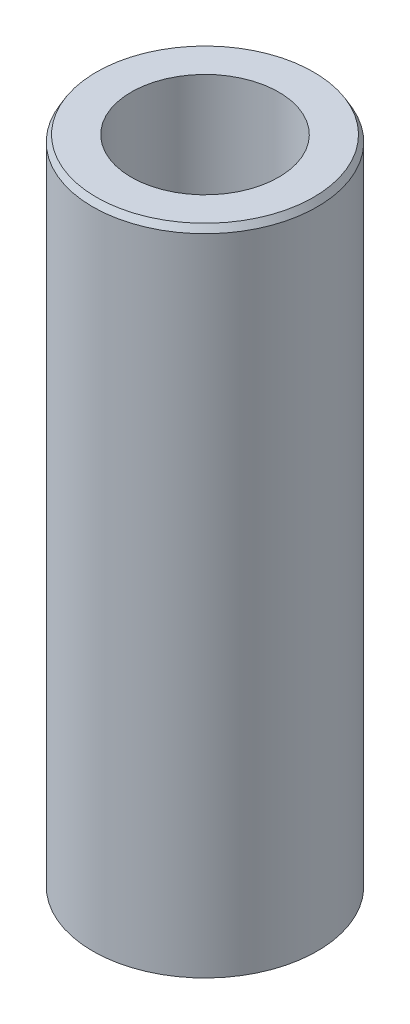
ISO-10303-21;
HEADER;
FILE_DESCRIPTION(('STEP AP214'),'2;1');
FILE_NAME('part.step','',(''),(''),'','','');
FILE_SCHEMA(('AUTOMOTIVE_DESIGN { 1 0 10303 214 1 1 1 1 }'));
ENDSEC;
DATA;
#1=APPLICATION_CONTEXT('core data for automotive mechanical design processes');
#2=APPLICATION_PROTOCOL_DEFINITION('international standard','automotive_design',2000,#1);
#3=PRODUCT_CONTEXT('',#1,'mechanical');
#4=PRODUCT('Part','Part','',(#3));
#5=PRODUCT_RELATED_PRODUCT_CATEGORY('part','',(#4));
#6=PRODUCT_DEFINITION_FORMATION('','',#4);
#7=PRODUCT_DEFINITION_CONTEXT('part definition',#1,'design');
#8=PRODUCT_DEFINITION('design','',#6,#7);
#9=PRODUCT_DEFINITION_SHAPE('','',#8);
#10=(LENGTH_UNIT() NAMED_UNIT(*) SI_UNIT(.MILLI.,.METRE.));
#11=(NAMED_UNIT(*) PLANE_ANGLE_UNIT() SI_UNIT($,.RADIAN.));
#12=(NAMED_UNIT(*) SI_UNIT($,.STERADIAN.) SOLID_ANGLE_UNIT());
#13=UNCERTAINTY_MEASURE_WITH_UNIT(LENGTH_MEASURE(1.E-05),#10,'distance_accuracy_value','');
#14=(GEOMETRIC_REPRESENTATION_CONTEXT(3) GLOBAL_UNCERTAINTY_ASSIGNED_CONTEXT((#13)) GLOBAL_UNIT_ASSIGNED_CONTEXT((#10,
#11,#12)) REPRESENTATION_CONTEXT('',''));
#15=CARTESIAN_POINT('',(0.,0.,0.));
#16=DIRECTION('',(0.,0.,1.));
#17=DIRECTION('',(1.,0.,0.));
#18=AXIS2_PLACEMENT_3D('',#15,#16,#17);
#19=CARTESIAN_POINT('',(0.,58.3154074401787,0.));
#20=DIRECTION('',(0.,-1.,0.));
#21=DIRECTION('',(0.,0.,-1.));
#22=AXIS2_PLACEMENT_3D('',#19,#20,#21);
#23=CYLINDRICAL_SURFACE('',#22,10.);
#24=CARTESIAN_POINT('',(0.,57.7418931094685,0.));
#25=DIRECTION('',(0.,1.,0.));
#26=DIRECTION('',(0.,0.,1.));
#27=AXIS2_PLACEMENT_3D('',#24,#25,#26);
#28=CIRCLE('',#27,10.);
#29=CARTESIAN_POINT('',(0.,57.7418931094685,10.));
#30=VERTEX_POINT('',#29);
#31=EDGE_CURVE('E50',#30,#30,#28,.F.);
#32=ORIENTED_EDGE('',*,*,#31,.T.);
#33=EDGE_LOOP('',(#32));
#34=FACE_BOUND('',#33,.T.);
#35=CARTESIAN_POINT('',(0.,0.331118653219657,0.));
#36=DIRECTION('',(0.,1.,0.));
#37=DIRECTION('',(0.,0.,1.));
#38=AXIS2_PLACEMENT_3D('',#35,#36,#37);
#39=CIRCLE('',#38,10.);
#40=CARTESIAN_POINT('',(0.,0.331118653219657,10.));
#41=VERTEX_POINT('',#40);
#42=EDGE_CURVE('E51',#41,#41,#39,.T.);
#43=ORIENTED_EDGE('',*,*,#42,.T.);
#44=EDGE_LOOP('',(#43));
#45=FACE_BOUND('',#44,.T.);
#46=ADVANCED_FACE('F39',(#34,#45),#23,.T.);
#47=CARTESIAN_POINT('',(0.,58.3154074401787,0.));
#48=DIRECTION('',(0.,1.,0.));
#49=DIRECTION('',(0.,0.,1.));
#50=AXIS2_PLACEMENT_3D('',#47,#48,#49);
#51=PLANE('',#50);
#52=CARTESIAN_POINT('',(0.,58.3154074401787,0.));
#53=DIRECTION('',(0.,1.,0.));
#54=DIRECTION('',(0.,0.,1.));
#55=AXIS2_PLACEMENT_3D('',#52,#53,#54);
#56=CIRCLE('',#55,9.66888134678033);
#57=CARTESIAN_POINT('',(0.,58.3154074401787,9.66888134678033));
#58=VERTEX_POINT('',#57);
#59=EDGE_CURVE('E54',#58,#58,#56,.T.);
#60=ORIENTED_EDGE('',*,*,#59,.T.);
#61=EDGE_LOOP('',(#60));
#62=FACE_BOUND('',#61,.T.);
#63=CARTESIAN_POINT('',(0.,58.3154074401787,0.));
#64=DIRECTION('',(0.,1.,0.));
#65=DIRECTION('',(0.,0.,1.));
#66=AXIS2_PLACEMENT_3D('',#63,#64,#65);
#67=CIRCLE('',#66,6.57091181176588);
#68=CARTESIAN_POINT('',(0.,58.3154074401787,6.57091181176588));
#69=VERTEX_POINT('',#68);
#70=EDGE_CURVE('E58',#69,#69,#67,.T.);
#71=ORIENTED_EDGE('',*,*,#70,.F.);
#72=EDGE_LOOP('',(#71));
#73=FACE_BOUND('',#72,.T.);
#74=ADVANCED_FACE('F69',(#62,#73),#51,.T.);
#75=CARTESIAN_POINT('',(0.,0.,0.));
#76=DIRECTION('',(0.,1.,0.));
#77=DIRECTION('',(0.,0.,1.));
#78=AXIS2_PLACEMENT_3D('',#75,#76,#77);
#79=PLANE('',#78);
#80=CARTESIAN_POINT('',(0.,0.,0.));
#81=DIRECTION('',(0.,1.,0.));
#82=DIRECTION('',(0.,0.,1.));
#83=AXIS2_PLACEMENT_3D('',#80,#81,#82);
#84=CIRCLE('',#83,9.42648566928979);
#85=CARTESIAN_POINT('',(0.,0.,9.42648566928979));
#86=VERTEX_POINT('',#85);
#87=EDGE_CURVE('E10',#86,#86,#84,.F.);
#88=ORIENTED_EDGE('',*,*,#87,.T.);
#89=EDGE_LOOP('',(#88));
#90=FACE_BOUND('',#89,.T.);
#91=CARTESIAN_POINT('',(0.,0.,0.));
#92=DIRECTION('',(0.,1.,0.));
#93=DIRECTION('',(0.,0.,1.));
#94=AXIS2_PLACEMENT_3D('',#91,#92,#93);
#95=CIRCLE('',#94,6.57091181176588);
#96=CARTESIAN_POINT('',(0.,0.,6.57091181176588));
#97=VERTEX_POINT('',#96);
#98=EDGE_CURVE('E63',#97,#97,#95,.T.);
#99=ORIENTED_EDGE('',*,*,#98,.T.);
#100=EDGE_LOOP('',(#99));
#101=FACE_BOUND('',#100,.T.);
#102=ADVANCED_FACE('F75',(#90,#101),#79,.F.);
#103=CARTESIAN_POINT('',(0.,58.3154074401787,0.));
#104=DIRECTION('',(0.,-1.,0.));
#105=DIRECTION('',(0.,0.,-1.));
#106=AXIS2_PLACEMENT_3D('',#103,#104,#105);
#107=CYLINDRICAL_SURFACE('',#106,6.57091181176588);
#108=ORIENTED_EDGE('',*,*,#70,.T.);
#109=EDGE_LOOP('',(#108));
#110=FACE_BOUND('',#109,.T.);
#111=ORIENTED_EDGE('',*,*,#98,.F.);
#112=EDGE_LOOP('',(#111));
#113=FACE_BOUND('',#112,.T.);
#114=ADVANCED_FACE('F70',(#110,#113),#107,.F.);
#115=CARTESIAN_POINT('',(0.,58.3154074401787,0.));
#116=DIRECTION('',(0.,-1.,0.));
#117=DIRECTION('',(0.,0.,-1.));
#118=AXIS2_PLACEMENT_3D('',#115,#116,#117);
#119=CONICAL_SURFACE('',#118,9.66888134678033,0.523598775598298);
#120=ORIENTED_EDGE('',*,*,#31,.F.);
#121=EDGE_LOOP('',(#120));
#122=FACE_BOUND('',#121,.T.);
#123=ORIENTED_EDGE('',*,*,#59,.F.);
#124=EDGE_LOOP('',(#123));
#125=FACE_BOUND('',#124,.T.);
#126=ADVANCED_FACE('F81',(#122,#125),#119,.T.);
#127=CARTESIAN_POINT('',(0.,0.331118653219657,0.));
#128=DIRECTION('',(0.,1.,0.));
#129=DIRECTION('',(0.,0.,1.));
#130=AXIS2_PLACEMENT_3D('',#127,#128,#129);
#131=CONICAL_SURFACE('',#130,10.,1.04719755119659);
#132=ORIENTED_EDGE('',*,*,#87,.F.);
#133=EDGE_LOOP('',(#132));
#134=FACE_BOUND('',#133,.T.);
#135=ORIENTED_EDGE('',*,*,#42,.F.);
#136=EDGE_LOOP('',(#135));
#137=FACE_BOUND('',#136,.T.);
#138=ADVANCED_FACE('F45',(#134,#137),#131,.T.);
#139=CLOSED_SHELL('',(#46,#74,#102,#114,#126,#138));
#140=MANIFOLD_SOLID_BREP('B2',#139);
#141=ADVANCED_BREP_SHAPE_REPRESENTATION('',(#18,#140),#14);
#142=SHAPE_DEFINITION_REPRESENTATION(#9,#141);
ENDSEC;
END-ISO-10303-21;
